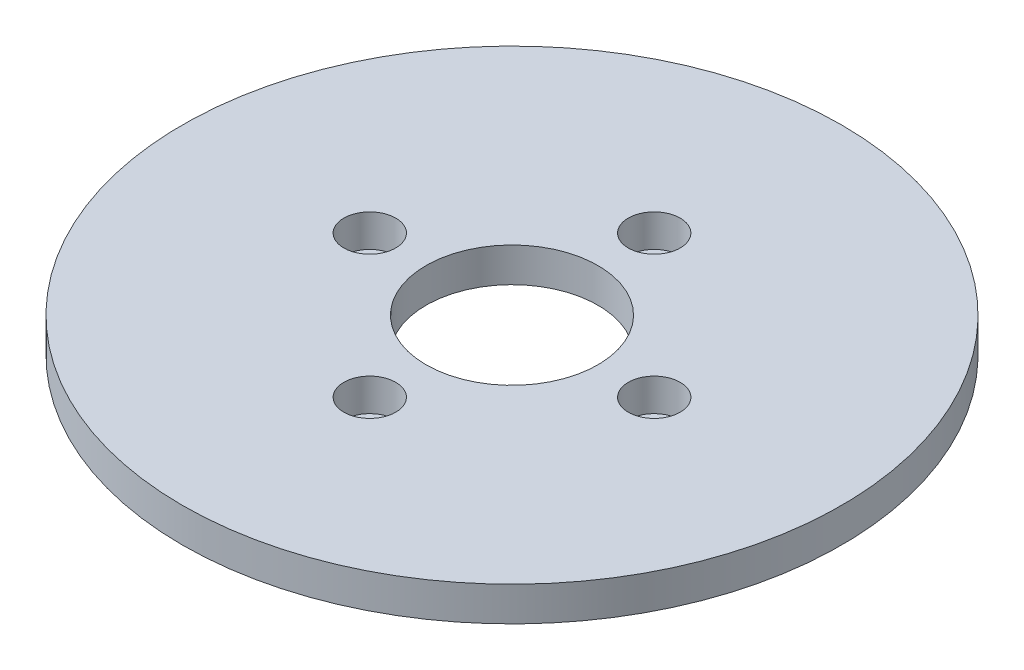
ISO-10303-21;
HEADER;
FILE_DESCRIPTION(('STEP AP214'),'2;1');
FILE_NAME('part.step','',(''),(''),'','','');
FILE_SCHEMA(('AUTOMOTIVE_DESIGN { 1 0 10303 214 1 1 1 1 }'));
ENDSEC;
DATA;
#1=APPLICATION_CONTEXT('core data for automotive mechanical design processes');
#2=APPLICATION_PROTOCOL_DEFINITION('international standard','automotive_design',2000,#1);
#3=PRODUCT_CONTEXT('',#1,'mechanical');
#4=PRODUCT('Part','Part','',(#3));
#5=PRODUCT_RELATED_PRODUCT_CATEGORY('part','',(#4));
#6=PRODUCT_DEFINITION_FORMATION('','',#4);
#7=PRODUCT_DEFINITION_CONTEXT('part definition',#1,'design');
#8=PRODUCT_DEFINITION('design','',#6,#7);
#9=PRODUCT_DEFINITION_SHAPE('','',#8);
#10=(LENGTH_UNIT() NAMED_UNIT(*) SI_UNIT(.MILLI.,.METRE.));
#11=(NAMED_UNIT(*) PLANE_ANGLE_UNIT() SI_UNIT($,.RADIAN.));
#12=(NAMED_UNIT(*) SI_UNIT($,.STERADIAN.) SOLID_ANGLE_UNIT());
#13=UNCERTAINTY_MEASURE_WITH_UNIT(LENGTH_MEASURE(1.E-05),#10,'distance_accuracy_value','');
#14=(GEOMETRIC_REPRESENTATION_CONTEXT(3) GLOBAL_UNCERTAINTY_ASSIGNED_CONTEXT((#13)) GLOBAL_UNIT_ASSIGNED_CONTEXT((#10,
#11,#12)) REPRESENTATION_CONTEXT('',''));
#15=CARTESIAN_POINT('',(0.,0.,0.));
#16=DIRECTION('',(0.,0.,1.));
#17=DIRECTION('',(1.,0.,0.));
#18=AXIS2_PLACEMENT_3D('',#15,#16,#17);
#19=CARTESIAN_POINT('',(0.,6.,0.));
#20=DIRECTION('',(0.,-1.,0.));
#21=DIRECTION('',(0.,0.,-1.));
#22=AXIS2_PLACEMENT_3D('',#19,#20,#21);
#23=CYLINDRICAL_SURFACE('',#22,57.5);
#24=CARTESIAN_POINT('',(0.,6.,0.));
#25=DIRECTION('',(0.,1.,0.));
#26=DIRECTION('',(0.,0.,1.));
#27=AXIS2_PLACEMENT_3D('',#24,#25,#26);
#28=CIRCLE('',#27,57.5);
#29=CARTESIAN_POINT('',(0.,6.,57.5));
#30=VERTEX_POINT('',#29);
#31=EDGE_CURVE('E10',#30,#30,#28,.T.);
#32=ORIENTED_EDGE('',*,*,#31,.F.);
#33=EDGE_LOOP('',(#32));
#34=FACE_BOUND('',#33,.T.);
#35=CARTESIAN_POINT('',(0.,0.,0.));
#36=DIRECTION('',(0.,1.,0.));
#37=DIRECTION('',(0.,0.,1.));
#38=AXIS2_PLACEMENT_3D('',#35,#36,#37);
#39=CIRCLE('',#38,57.5);
#40=CARTESIAN_POINT('',(0.,0.,57.5));
#41=VERTEX_POINT('',#40);
#42=EDGE_CURVE('E37',#41,#41,#39,.T.);
#43=ORIENTED_EDGE('',*,*,#42,.T.);
#44=EDGE_LOOP('',(#43));
#45=FACE_BOUND('',#44,.T.);
#46=ADVANCED_FACE('F40',(#34,#45),#23,.T.);
#47=CARTESIAN_POINT('',(0.,6.,0.));
#48=DIRECTION('',(0.,1.,0.));
#49=DIRECTION('',(0.,0.,1.));
#50=AXIS2_PLACEMENT_3D('',#47,#48,#49);
#51=PLANE('',#50);
#52=CARTESIAN_POINT('',(0.,6.,24.8134033526954));
#53=DIRECTION('',(0.,1.,0.));
#54=DIRECTION('',(1.,0.,0.));
#55=AXIS2_PLACEMENT_3D('',#52,#53,#54);
#56=CIRCLE('',#55,4.52633021607741);
#57=CARTESIAN_POINT('',(4.5263302160775,6.,24.8134033526954));
#58=VERTEX_POINT('',#57);
#59=EDGE_CURVE('E71',#58,#58,#56,.T.);
#60=ORIENTED_EDGE('',*,*,#59,.F.);
#61=EDGE_LOOP('',(#60));
#62=FACE_BOUND('',#61,.T.);
#63=CARTESIAN_POINT('',(24.8134033526954,6.,0.));
#64=DIRECTION('',(0.,1.,0.));
#65=DIRECTION('',(0.,0.,-1.));
#66=AXIS2_PLACEMENT_3D('',#63,#64,#65);
#67=CIRCLE('',#66,4.52633021607741);
#68=CARTESIAN_POINT('',(24.8134033526954,6.,-4.52633021607741));
#69=VERTEX_POINT('',#68);
#70=EDGE_CURVE('E70',#69,#69,#67,.T.);
#71=ORIENTED_EDGE('',*,*,#70,.F.);
#72=EDGE_LOOP('',(#71));
#73=FACE_BOUND('',#72,.T.);
#74=CARTESIAN_POINT('',(-2.59906604277371E-13,6.,-24.8134033526954));
#75=DIRECTION('',(0.,1.,0.));
#76=DIRECTION('',(-1.,0.,0.));
#77=AXIS2_PLACEMENT_3D('',#74,#75,#76);
#78=CIRCLE('',#77,4.52633021607741);
#79=CARTESIAN_POINT('',(-4.52633021607767,6.,-24.8134033526954));
#80=VERTEX_POINT('',#79);
#81=EDGE_CURVE('E61',#80,#80,#78,.T.);
#82=ORIENTED_EDGE('',*,*,#81,.F.);
#83=EDGE_LOOP('',(#82));
#84=FACE_BOUND('',#83,.T.);
#85=CARTESIAN_POINT('',(-24.8134033526954,6.,0.));
#86=DIRECTION('',(0.,1.,0.));
#87=DIRECTION('',(0.,0.,1.));
#88=AXIS2_PLACEMENT_3D('',#85,#86,#87);
#89=CIRCLE('',#88,4.52633021607741);
#90=CARTESIAN_POINT('',(-24.8134033526954,6.,4.52633021607741));
#91=VERTEX_POINT('',#90);
#92=EDGE_CURVE('E54',#91,#91,#89,.T.);
#93=ORIENTED_EDGE('',*,*,#92,.F.);
#94=EDGE_LOOP('',(#93));
#95=FACE_BOUND('',#94,.T.);
#96=CARTESIAN_POINT('',(0.,6.,0.));
#97=DIRECTION('',(0.,1.,0.));
#98=DIRECTION('',(0.,0.,1.));
#99=AXIS2_PLACEMENT_3D('',#96,#97,#98);
#100=CIRCLE('',#99,15.);
#101=CARTESIAN_POINT('',(0.,6.,15.));
#102=VERTEX_POINT('',#101);
#103=EDGE_CURVE('E50',#102,#102,#100,.T.);
#104=ORIENTED_EDGE('',*,*,#103,.F.);
#105=EDGE_LOOP('',(#104));
#106=FACE_BOUND('',#105,.T.);
#107=ORIENTED_EDGE('',*,*,#31,.T.);
#108=EDGE_LOOP('',(#107));
#109=FACE_BOUND('',#108,.T.);
#110=ADVANCED_FACE('F86',(#62,#73,#84,#95,#106,#109),#51,.T.);
#111=CARTESIAN_POINT('',(0.,0.,0.));
#112=DIRECTION('',(0.,1.,0.));
#113=DIRECTION('',(0.,0.,1.));
#114=AXIS2_PLACEMENT_3D('',#111,#112,#113);
#115=PLANE('',#114);
#116=CARTESIAN_POINT('',(0.,0.,0.));
#117=DIRECTION('',(0.,1.,0.));
#118=DIRECTION('',(0.,0.,1.));
#119=AXIS2_PLACEMENT_3D('',#116,#117,#118);
#120=CIRCLE('',#119,15.);
#121=CARTESIAN_POINT('',(0.,0.,15.));
#122=VERTEX_POINT('',#121);
#123=EDGE_CURVE('E47',#122,#122,#120,.T.);
#124=ORIENTED_EDGE('',*,*,#123,.T.);
#125=EDGE_LOOP('',(#124));
#126=FACE_BOUND('',#125,.T.);
#127=ORIENTED_EDGE('',*,*,#42,.F.);
#128=EDGE_LOOP('',(#127));
#129=FACE_BOUND('',#128,.T.);
#130=ADVANCED_FACE('F93',(#126,#129),#115,.F.);
#131=CARTESIAN_POINT('',(0.,6.,0.));
#132=DIRECTION('',(0.,-1.,0.));
#133=DIRECTION('',(0.,0.,-1.));
#134=AXIS2_PLACEMENT_3D('',#131,#132,#133);
#135=CYLINDRICAL_SURFACE('',#134,15.);
#136=ORIENTED_EDGE('',*,*,#103,.T.);
#137=EDGE_LOOP('',(#136));
#138=FACE_BOUND('',#137,.T.);
#139=ORIENTED_EDGE('',*,*,#123,.F.);
#140=EDGE_LOOP('',(#139));
#141=FACE_BOUND('',#140,.T.);
#142=ADVANCED_FACE('F101',(#138,#141),#135,.F.);
#143=CARTESIAN_POINT('',(-24.8134033526954,0.322814696762757,0.));
#144=DIRECTION('',(0.,1.,0.));
#145=DIRECTION('',(0.,0.,1.));
#146=AXIS2_PLACEMENT_3D('',#143,#144,#145);
#147=CYLINDRICAL_SURFACE('',#146,4.52633021607741);
#148=CARTESIAN_POINT('',(-24.8134033526954,0.322814696762757,0.));
#149=DIRECTION('',(0.,1.,0.));
#150=DIRECTION('',(0.,0.,1.));
#151=AXIS2_PLACEMENT_3D('',#148,#149,#150);
#152=CIRCLE('',#151,4.52633021607741);
#153=CARTESIAN_POINT('',(-24.8134033526954,0.322814696762757,4.52633021607741));
#154=VERTEX_POINT('',#153);
#155=EDGE_CURVE('E55',#154,#154,#152,.T.);
#156=ORIENTED_EDGE('',*,*,#155,.F.);
#157=EDGE_LOOP('',(#156));
#158=FACE_BOUND('',#157,.T.);
#159=ORIENTED_EDGE('',*,*,#92,.T.);
#160=EDGE_LOOP('',(#159));
#161=FACE_BOUND('',#160,.T.);
#162=ADVANCED_FACE('F102',(#158,#161),#147,.F.);
#163=CARTESIAN_POINT('',(-24.8134033526954,0.322814696762757,0.));
#164=DIRECTION('',(0.,1.,0.));
#165=DIRECTION('',(0.,0.,1.));
#166=AXIS2_PLACEMENT_3D('',#163,#164,#165);
#167=PLANE('',#166);
#168=ORIENTED_EDGE('',*,*,#155,.T.);
#169=EDGE_LOOP('',(#168));
#170=FACE_BOUND('',#169,.T.);
#171=ADVANCED_FACE('F133',(#170),#167,.T.);
#172=CARTESIAN_POINT('',(-2.59906604277371E-13,0.322814696762757,-24.8134033526954));
#173=DIRECTION('',(0.,1.,0.));
#174=DIRECTION('',(0.,0.,1.));
#175=AXIS2_PLACEMENT_3D('',#172,#173,#174);
#176=CYLINDRICAL_SURFACE('',#175,4.52633021607741);
#177=CARTESIAN_POINT('',(-2.59906604277371E-13,0.322814696762757,-24.8134033526954));
#178=DIRECTION('',(0.,1.,0.));
#179=DIRECTION('',(-1.,0.,0.));
#180=AXIS2_PLACEMENT_3D('',#177,#178,#179);
#181=CIRCLE('',#180,4.52633021607741);
#182=CARTESIAN_POINT('',(-4.52633021607767,0.322814696762757,-24.8134033526954));
#183=VERTEX_POINT('',#182);
#184=EDGE_CURVE('E63',#183,#183,#181,.T.);
#185=ORIENTED_EDGE('',*,*,#184,.F.);
#186=EDGE_LOOP('',(#185));
#187=FACE_BOUND('',#186,.T.);
#188=ORIENTED_EDGE('',*,*,#81,.T.);
#189=EDGE_LOOP('',(#188));
#190=FACE_BOUND('',#189,.T.);
#191=ADVANCED_FACE('F142',(#187,#190),#176,.F.);
#192=CARTESIAN_POINT('',(-2.59906604277371E-13,0.322814696762757,-24.8134033526954));
#193=DIRECTION('',(0.,1.,0.));
#194=DIRECTION('',(-1.,0.,0.));
#195=AXIS2_PLACEMENT_3D('',#192,#193,#194);
#196=PLANE('',#195);
#197=ORIENTED_EDGE('',*,*,#184,.T.);
#198=EDGE_LOOP('',(#197));
#199=FACE_BOUND('',#198,.T.);
#200=ADVANCED_FACE('F156',(#199),#196,.T.);
#201=CARTESIAN_POINT('',(24.8134033526954,0.322814696762757,0.));
#202=DIRECTION('',(0.,1.,0.));
#203=DIRECTION('',(0.,0.,1.));
#204=AXIS2_PLACEMENT_3D('',#201,#202,#203);
#205=CYLINDRICAL_SURFACE('',#204,4.52633021607741);
#206=CARTESIAN_POINT('',(24.8134033526954,0.322814696762757,0.));
#207=DIRECTION('',(0.,1.,0.));
#208=DIRECTION('',(0.,0.,-1.));
#209=AXIS2_PLACEMENT_3D('',#206,#207,#208);
#210=CIRCLE('',#209,4.52633021607741);
#211=CARTESIAN_POINT('',(24.8134033526954,0.322814696762757,-4.52633021607741));
#212=VERTEX_POINT('',#211);
#213=EDGE_CURVE('E69',#212,#212,#210,.T.);
#214=ORIENTED_EDGE('',*,*,#213,.F.);
#215=EDGE_LOOP('',(#214));
#216=FACE_BOUND('',#215,.T.);
#217=ORIENTED_EDGE('',*,*,#70,.T.);
#218=EDGE_LOOP('',(#217));
#219=FACE_BOUND('',#218,.T.);
#220=ADVANCED_FACE('F164',(#216,#219),#205,.F.);
#221=CARTESIAN_POINT('',(24.8134033526954,0.322814696762757,0.));
#222=DIRECTION('',(0.,1.,0.));
#223=DIRECTION('',(0.,0.,-1.));
#224=AXIS2_PLACEMENT_3D('',#221,#222,#223);
#225=PLANE('',#224);
#226=ORIENTED_EDGE('',*,*,#213,.T.);
#227=EDGE_LOOP('',(#226));
#228=FACE_BOUND('',#227,.T.);
#229=ADVANCED_FACE('F83',(#228),#225,.T.);
#230=CARTESIAN_POINT('',(0.,0.322814696762757,24.8134033526954));
#231=DIRECTION('',(0.,1.,0.));
#232=DIRECTION('',(0.,0.,1.));
#233=AXIS2_PLACEMENT_3D('',#230,#231,#232);
#234=CYLINDRICAL_SURFACE('',#233,4.52633021607741);
#235=CARTESIAN_POINT('',(0.,0.322814696762757,24.8134033526954));
#236=DIRECTION('',(0.,1.,0.));
#237=DIRECTION('',(1.,0.,0.));
#238=AXIS2_PLACEMENT_3D('',#235,#236,#237);
#239=CIRCLE('',#238,4.52633021607741);
#240=CARTESIAN_POINT('',(4.5263302160775,0.322814696762757,24.8134033526954));
#241=VERTEX_POINT('',#240);
#242=EDGE_CURVE('E59',#241,#241,#239,.T.);
#243=ORIENTED_EDGE('',*,*,#242,.F.);
#244=EDGE_LOOP('',(#243));
#245=FACE_BOUND('',#244,.T.);
#246=ORIENTED_EDGE('',*,*,#59,.T.);
#247=EDGE_LOOP('',(#246));
#248=FACE_BOUND('',#247,.T.);
#249=ADVANCED_FACE('F81',(#245,#248),#234,.F.);
#250=CARTESIAN_POINT('',(0.,0.322814696762757,24.8134033526954));
#251=DIRECTION('',(0.,1.,0.));
#252=DIRECTION('',(1.,0.,0.));
#253=AXIS2_PLACEMENT_3D('',#250,#251,#252);
#254=PLANE('',#253);
#255=ORIENTED_EDGE('',*,*,#242,.T.);
#256=EDGE_LOOP('',(#255));
#257=FACE_BOUND('',#256,.T.);
#258=ADVANCED_FACE('F78',(#257),#254,.T.);
#259=CLOSED_SHELL('',(#46,#110,#130,#142,#162,#171,#191,#200,#220,#229,#249,#258));
#260=MANIFOLD_SOLID_BREP('B2',#259);
#261=ADVANCED_BREP_SHAPE_REPRESENTATION('',(#18,#260),#14);
#262=SHAPE_DEFINITION_REPRESENTATION(#9,#261);
ENDSEC;
END-ISO-10303-21;
